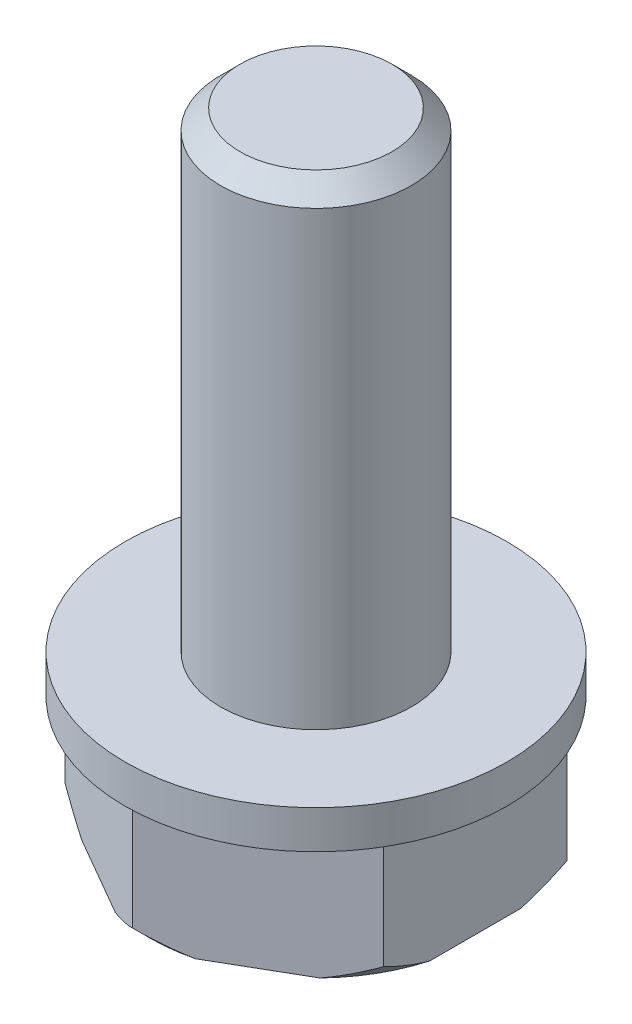
ISO-10303-21;
HEADER;
FILE_DESCRIPTION(('STEP AP214'),'2;1');
FILE_NAME('part.step','',(''),(''),'','','');
FILE_SCHEMA(('AUTOMOTIVE_DESIGN { 1 0 10303 214 1 1 1 1 }'));
ENDSEC;
DATA;
#1=APPLICATION_CONTEXT('core data for automotive mechanical design processes');
#2=APPLICATION_PROTOCOL_DEFINITION('international standard','automotive_design',2000,#1);
#3=PRODUCT_CONTEXT('',#1,'mechanical');
#4=PRODUCT('Part','Part','',(#3));
#5=PRODUCT_RELATED_PRODUCT_CATEGORY('part','',(#4));
#6=PRODUCT_DEFINITION_FORMATION('','',#4);
#7=PRODUCT_DEFINITION_CONTEXT('part definition',#1,'design');
#8=PRODUCT_DEFINITION('design','',#6,#7);
#9=PRODUCT_DEFINITION_SHAPE('','',#8);
#10=(LENGTH_UNIT() NAMED_UNIT(*) SI_UNIT(.MILLI.,.METRE.));
#11=(NAMED_UNIT(*) PLANE_ANGLE_UNIT() SI_UNIT($,.RADIAN.));
#12=(NAMED_UNIT(*) SI_UNIT($,.STERADIAN.) SOLID_ANGLE_UNIT());
#13=UNCERTAINTY_MEASURE_WITH_UNIT(LENGTH_MEASURE(1.E-05),#10,'distance_accuracy_value','');
#14=(GEOMETRIC_REPRESENTATION_CONTEXT(3) GLOBAL_UNCERTAINTY_ASSIGNED_CONTEXT((#13)) GLOBAL_UNIT_ASSIGNED_CONTEXT((#10,
#11,#12)) REPRESENTATION_CONTEXT('',''));
#15=CARTESIAN_POINT('',(0.,0.,0.));
#16=DIRECTION('',(0.,0.,1.));
#17=DIRECTION('',(1.,0.,0.));
#18=AXIS2_PLACEMENT_3D('',#15,#16,#17);
#19=CARTESIAN_POINT('',(-12.6776695296637,96.5,-20.5644208756118));
#20=DIRECTION('',(-0.5,0.,0.866025403784439));
#21=DIRECTION('',(0.866025403784439,0.,0.5));
#22=AXIS2_PLACEMENT_3D('',#19,#20,#21);
#23=PLANE('',#22);
#24=DIRECTION('',(0.,-1.,0.));
#25=VECTOR('',#24,1.);
#26=CARTESIAN_POINT('',(-12.6776695296637,96.5,-20.5644208756118));
#27=LINE('',#26,#25);
#28=CARTESIAN_POINT('',(-12.6776695296637,50.5,-20.5644208756118));
#29=VERTEX_POINT('',#28);
#30=CARTESIAN_POINT('',(-12.6776695296637,47.0735026918963,-20.5644208756118));
#31=VERTEX_POINT('',#30);
#32=EDGE_CURVE('E11',#29,#31,#27,.T.);
#33=ORIENTED_EDGE('',*,*,#32,.T.);
#34=CARTESIAN_POINT('',(-13.9407378419784,46.5,-21.2936537057316));
#35=CARTESIAN_POINT('',(-13.8888852998626,46.5164440766261,-21.2637151211004));
#36=CARTESIAN_POINT('',(-13.8372495435169,46.5337687545802,-21.2338904269128));
#37=CARTESIAN_POINT('',(-13.7338516018748,46.5702823086314,-21.1741594018992));
#38=CARTESIAN_POINT('',(-13.6820943622336,46.5894897238432,-21.1442558321939));
#39=CARTESIAN_POINT('',(-13.5783633971793,46.6297670931508,-21.0843293780453));
#40=CARTESIAN_POINT('',(-13.5263958373998,46.6508582920278,-21.054310131997));
#41=CARTESIAN_POINT('',(-13.4221600511645,46.6949003649628,-20.9941094242253));
#42=CARTESIAN_POINT('',(-13.3698991333133,46.7178745106764,-20.9639323574686));
#43=CARTESIAN_POINT('',(-13.2649997798865,46.7656807395659,-20.9033725653862));
#44=CARTESIAN_POINT('',(-13.212369709376,46.7905375181192,-20.8729948770988));
#45=CARTESIAN_POINT('',(-13.1066617384088,46.8421079012049,-20.8119895662205));
#46=CARTESIAN_POINT('',(-13.0535931424491,46.8688470805479,-20.7813674698508));
#47=CARTESIAN_POINT('',(-12.9469443837856,46.9241810640024,-20.7198294215317));
#48=CARTESIAN_POINT('',(-12.8933743396931,46.9528018406309,-20.6889193342318));
#49=CARTESIAN_POINT('',(-12.7856642307774,47.0119007649667,-20.6267615953025));
#50=CARTESIAN_POINT('',(-12.7315349477506,47.042404941688,-20.5955199875061));
#51=CARTESIAN_POINT('',(-12.6776695296637,47.0735026918963,-20.5644208756118));
#52=B_SPLINE_CURVE_WITH_KNOTS('',3,(#34,#35,#36,#37,#38,#39,#40,#41,#42,#43,#44,#45,#46,#47,#48,
#49,#50,#51),.UNSPECIFIED.,.F.,.F.,(4,2,2,2,2,2,2,2,4),(0.,0.18626522227709,0.374595608167034,
0.565412784427951,0.759111232115711,0.956057798253881,1.15659171756843,1.36102506604505,
1.56964356219137),.UNSPECIFIED.);
#53=CARTESIAN_POINT('',(-13.9407378419784,46.5,-21.2936537057316));
#54=VERTEX_POINT('',#53);
#55=EDGE_CURVE('E342',#54,#31,#52,.T.);
#56=ORIENTED_EDGE('',*,*,#55,.F.);
#57=DIRECTION('',(0.866025403784439,0.,0.5));
#58=VECTOR('',#57,1.);
#59=CARTESIAN_POINT('',(-11.2776695296637,46.5,-19.7561304987464));
#60=LINE('',#59,#58);
#61=CARTESIAN_POINT('',(-16.414601217349,46.5,-22.7219393914402));
#62=VERTEX_POINT('',#61);
#63=EDGE_CURVE('E347',#62,#54,#60,.T.);
#64=ORIENTED_EDGE('',*,*,#63,.F.);
#65=CARTESIAN_POINT('',(-17.6776695296637,47.0735026918963,-23.45117222156));
#66=CARTESIAN_POINT('',(-17.6238041996847,47.042404941688,-23.4200729570584));
#67=CARTESIAN_POINT('',(-17.5696835321645,47.0119007649667,-23.3888164267667));
#68=CARTESIAN_POINT('',(-17.4619982967521,46.9528018406309,-23.326615605666));
#69=CARTESIAN_POINT('',(-17.4084443538709,46.9241810640024,-23.29567763025));
#70=CARTESIAN_POINT('',(-17.3018264613955,46.8688470805479,-23.2340861201248));
#71=CARTESIAN_POINT('',(-17.2487726500423,46.8421079012049,-23.2034384160655));
#72=CARTESIAN_POINT('',(-17.1430865155724,46.7905375181192,-23.1423952832645));
#73=CARTESIAN_POINT('',(-17.090463630552,46.7656807395659,-23.1120051493432));
#74=CARTESIAN_POINT('',(-16.9855676354473,46.7178745106764,-23.0514395404762));
#75=CARTESIAN_POINT('',(-16.9333030700988,46.6949003649628,-23.0212687913703));
#76=CARTESIAN_POINT('',(-16.829049834725,46.6508582920278,-22.9610983063928));
#77=CARTESIAN_POINT('',(-16.7770686251549,46.6297670931507,-22.9311027024754));
#78=CARTESIAN_POINT('',(-16.6733053109764,46.5894897238432,-22.8712322786535));
#79=CARTESIAN_POINT('',(-16.6215294401272,46.5702823086314,-22.8413609791471));
#80=CARTESIAN_POINT('',(-16.5181018842503,46.5337687545802,-22.7816812474928));
#81=CARTESIAN_POINT('',(-16.4664550632509,46.5164440766261,-22.7518757178476));
#82=CARTESIAN_POINT('',(-16.414601217349,46.5,-22.7219393914402));
#83=B_SPLINE_CURVE_WITH_KNOTS('',3,(#65,#66,#67,#68,#69,#70,#71,#72,#73,#74,#75,#76,#77,#78,#79,
#80,#81,#82),.UNSPECIFIED.,.F.,.F.,(4,2,2,2,2,2,2,2,4),(0.,0.208618496146344,0.413051844622974,
0.613585763937537,0.810532330075709,1.00423077776348,1.19504795402439,1.38337833991432,
1.5696435621914),.UNSPECIFIED.);
#84=CARTESIAN_POINT('',(-17.6776695296637,47.0735026918963,-23.4511722215599));
#85=VERTEX_POINT('',#84);
#86=EDGE_CURVE('E485',#85,#62,#83,.T.);
#87=ORIENTED_EDGE('',*,*,#86,.F.);
#88=DIRECTION('',(0.,-1.,0.));
#89=VECTOR('',#88,1.);
#90=CARTESIAN_POINT('',(-17.6776695296637,96.5,-23.4511722215599));
#91=LINE('',#90,#89);
#92=CARTESIAN_POINT('',(-17.6776695296637,50.5,-23.4511722215599));
#93=VERTEX_POINT('',#92);
#94=EDGE_CURVE('E364',#93,#85,#91,.T.);
#95=ORIENTED_EDGE('',*,*,#94,.F.);
#96=DIRECTION('',(-0.866025403784439,0.,-0.5));
#97=VECTOR('',#96,1.);
#98=CARTESIAN_POINT('',(-12.9276695296637,50.5,-20.7087584429092));
#99=LINE('',#98,#97);
#100=EDGE_CURVE('E489',#29,#93,#99,.T.);
#101=ORIENTED_EDGE('',*,*,#100,.F.);
#102=EDGE_LOOP('',(#33,#56,#64,#87,#95,#101));
#103=FACE_BOUND('',#102,.T.);
#104=ADVANCED_FACE('F16',(#103),#23,.F.);
#105=CARTESIAN_POINT('',(-12.6776695296637,96.5,-14.7909181837156));
#106=DIRECTION('',(-1.,0.,0.));
#107=DIRECTION('',(0.,0.,1.));
#108=AXIS2_PLACEMENT_3D('',#105,#106,#107);
#109=PLANE('',#108);
#110=DIRECTION('',(0.,-1.,0.));
#111=VECTOR('',#110,1.);
#112=CARTESIAN_POINT('',(-12.6776695296637,96.5,-14.7909181837156));
#113=LINE('',#112,#111);
#114=CARTESIAN_POINT('',(-12.6776695296637,50.5,-14.7909181837156));
#115=VERTEX_POINT('',#114);
#116=CARTESIAN_POINT('',(-12.6776695296637,47.0735026918963,-14.7909181837156));
#117=VERTEX_POINT('',#116);
#118=EDGE_CURVE('E127',#115,#117,#113,.T.);
#119=ORIENTED_EDGE('',*,*,#118,.T.);
#120=CARTESIAN_POINT('',(-12.6776695296637,46.5,-16.2493838439551));
#121=CARTESIAN_POINT('',(-12.6776708334498,46.5164440766261,-16.1895089329165));
#122=CARTESIAN_POINT('',(-12.6776818981035,46.5337687545802,-16.1298787090837));
#123=CARTESIAN_POINT('',(-12.6777115123383,46.5702823086314,-16.0104679524158));
#124=CARTESIAN_POINT('',(-12.6777301435463,46.5894897238432,-15.9506930832041));
#125=CARTESIAN_POINT('',(-12.6777624926705,46.6297670931507,-15.8308962052337));
#126=CARTESIAN_POINT('',(-12.6777761424612,46.6508582920278,-15.7708813552678));
#127=CARTESIAN_POINT('',(-12.6777935915996,46.6949003649628,-15.6505101625187));
#128=CARTESIAN_POINT('',(-12.677797239097,46.7178745106764,-15.5901623466561));
#129=CARTESIAN_POINT('',(-12.6777938807748,46.7656807395659,-15.4690369457068));
#130=CARTESIAN_POINT('',(-12.6777866952847,46.7905375181192,-15.408269123498));
#131=CARTESIAN_POINT('',(-12.6777648587874,46.8421079012049,-15.2862206798188));
#132=CARTESIAN_POINT('',(-12.677750074181,46.8688470805479,-15.2249508793897));
#133=CARTESIAN_POINT('',(-12.6777192079928,46.9241810640024,-15.1018213209455));
#134=CARTESIAN_POINT('',(-12.6777031067814,46.9528018406309,-15.0399732582295));
#135=CARTESIAN_POINT('',(-12.6776782332782,47.0119007649667,-14.9156146981995));
#136=CARTESIAN_POINT('',(-12.6776696177716,47.042404941688,-14.8531165601114));
#137=CARTESIAN_POINT('',(-12.6776695296637,47.0735026918963,-14.7909181837156));
#138=B_SPLINE_CURVE_WITH_KNOTS('',3,(#120,#121,#122,#123,#124,#125,#126,#127,#128,#129,#130,
#131,#132,#133,#134,#135,#136,#137),.UNSPECIFIED.,.F.,.F.,(4,2,2,2,2,2,2,2,4),(0.,
0.186265222277092,0.37459560816703,0.565412784427947,0.759111232115713,0.956057798253881,
1.15659171756844,1.36102506604505,1.56964356219138),.UNSPECIFIED.);
#139=CARTESIAN_POINT('',(-12.6776695296637,46.5,-16.2493838439551));
#140=VERTEX_POINT('',#139);
#141=EDGE_CURVE('E29',#140,#117,#138,.T.);
#142=ORIENTED_EDGE('',*,*,#141,.F.);
#143=DIRECTION('',(0.,0.,1.));
#144=VECTOR('',#143,1.);
#145=CARTESIAN_POINT('',(-12.6776695296637,46.5,-17.6776695296637));
#146=LINE('',#145,#144);
#147=CARTESIAN_POINT('',(-12.6776695296637,46.5,-19.1059552153723));
#148=VERTEX_POINT('',#147);
#149=EDGE_CURVE('E292',#148,#140,#146,.T.);
#150=ORIENTED_EDGE('',*,*,#149,.F.);
#151=CARTESIAN_POINT('',(-12.6776695296637,47.0735026918963,-20.5644208756118));
#152=CARTESIAN_POINT('',(-12.6776696177716,47.0424049416879,-20.502222499216));
#153=CARTESIAN_POINT('',(-12.6776782332782,47.0119007649667,-20.4397243611279));
#154=CARTESIAN_POINT('',(-12.6777031067814,46.9528018406309,-20.3153658010979));
#155=CARTESIAN_POINT('',(-12.6777192079928,46.9241810640024,-20.2535177383819));
#156=CARTESIAN_POINT('',(-12.677750074181,46.8688470805479,-20.1303881799377));
#157=CARTESIAN_POINT('',(-12.6777648587874,46.8421079012049,-20.0691183795086));
#158=CARTESIAN_POINT('',(-12.6777866952847,46.7905375181192,-19.9470699358293));
#159=CARTESIAN_POINT('',(-12.6777938807748,46.7656807395659,-19.8863021136206));
#160=CARTESIAN_POINT('',(-12.677797239097,46.7178745106764,-19.7651767126712));
#161=CARTESIAN_POINT('',(-12.6777935915996,46.6949003649628,-19.7048288968087));
#162=CARTESIAN_POINT('',(-12.6777761424612,46.6508582920278,-19.5844577040595));
#163=CARTESIAN_POINT('',(-12.6777624926706,46.6297670931507,-19.5244428540937));
#164=CARTESIAN_POINT('',(-12.6777301435463,46.5894897238432,-19.4046459761233));
#165=CARTESIAN_POINT('',(-12.6777115123383,46.5702823086314,-19.3448711069116));
#166=CARTESIAN_POINT('',(-12.6776818981035,46.5337687545802,-19.2254603502437));
#167=CARTESIAN_POINT('',(-12.6776708334498,46.5164440766261,-19.1658301264109));
#168=CARTESIAN_POINT('',(-12.6776695296637,46.5,-19.1059552153723));
#169=B_SPLINE_CURVE_WITH_KNOTS('',3,(#151,#152,#153,#154,#155,#156,#157,#158,#159,#160,#161,
#162,#163,#164,#165,#166,#167,#168),.UNSPECIFIED.,.F.,.F.,(4,2,2,2,2,2,2,2,4),(0.,
0.208618496146355,0.413051844622993,0.613585763937558,0.810532330075726,1.00423077776349,
1.19504795402439,1.38337833991431,1.56964356219138),.UNSPECIFIED.);
#170=EDGE_CURVE('E123',#31,#148,#169,.T.);
#171=ORIENTED_EDGE('',*,*,#170,.F.);
#172=ORIENTED_EDGE('',*,*,#32,.F.);
#173=DIRECTION('',(0.,0.,-1.));
#174=VECTOR('',#173,1.);
#175=CARTESIAN_POINT('',(-12.6776695296637,50.5,-17.6776695296637));
#176=LINE('',#175,#174);
#177=EDGE_CURVE('E130',#115,#29,#176,.T.);
#178=ORIENTED_EDGE('',*,*,#177,.F.);
#179=EDGE_LOOP('',(#119,#142,#150,#171,#172,#178));
#180=FACE_BOUND('',#179,.T.);
#181=ADVANCED_FACE('F128',(#180),#109,.F.);
#182=CARTESIAN_POINT('',(-17.6776695296637,47.3,-17.6776695296637));
#183=DIRECTION('',(0.,1.,0.));
#184=DIRECTION('',(0.,0.,1.));
#185=AXIS2_PLACEMENT_3D('',#182,#183,#184);
#186=CONICAL_SURFACE('',#185,6.,0.785398163397448);
#187=CARTESIAN_POINT('',(-17.6776695296637,46.5,-17.6776695296637));
#188=DIRECTION('',(0.,-1.,0.));
#189=DIRECTION('',(0.,0.,-1.));
#190=AXIS2_PLACEMENT_3D('',#187,#188,#189);
#191=CIRCLE('',#190,5.2);
#192=CARTESIAN_POINT('',(-13.9407378419784,46.5,-14.0616853535958));
#193=VERTEX_POINT('',#192);
#194=EDGE_CURVE('E118',#140,#193,#191,.T.);
#195=ORIENTED_EDGE('',*,*,#194,.F.);
#196=ORIENTED_EDGE('',*,*,#141,.T.);
#197=CARTESIAN_POINT('',(-12.6776695296637,47.0735026918963,-14.7909181837156));
#198=CARTESIAN_POINT('',(-12.7315349477506,47.042404941688,-14.7598190718213));
#199=CARTESIAN_POINT('',(-12.7856642307774,47.0119007649667,-14.7285774640249));
#200=CARTESIAN_POINT('',(-12.8933743396931,46.9528018406309,-14.6664197250956));
#201=CARTESIAN_POINT('',(-12.9469443837856,46.9241810640024,-14.6355096377956));
#202=CARTESIAN_POINT('',(-13.0535931424492,46.8688470805479,-14.5739715894766));
#203=CARTESIAN_POINT('',(-13.1066617384088,46.8421079012049,-14.5433494931068));
#204=CARTESIAN_POINT('',(-13.212369709376,46.7905375181192,-14.4823441822286));
#205=CARTESIAN_POINT('',(-13.2649997798865,46.7656807395659,-14.4519664939412));
#206=CARTESIAN_POINT('',(-13.3698991333133,46.7178745106764,-14.3914067018588));
#207=CARTESIAN_POINT('',(-13.4221600511645,46.6949003649628,-14.3612296351021));
#208=CARTESIAN_POINT('',(-13.5263958373999,46.6508582920278,-14.3010289273304));
#209=CARTESIAN_POINT('',(-13.5783633971793,46.6297670931507,-14.2710096812821));
#210=CARTESIAN_POINT('',(-13.6820943622336,46.5894897238432,-14.2110832271335));
#211=CARTESIAN_POINT('',(-13.7338516018748,46.5702823086314,-14.1811796574282));
#212=CARTESIAN_POINT('',(-13.8372495435169,46.5337687545802,-14.1214486324146));
#213=CARTESIAN_POINT('',(-13.8888852998626,46.5164440766261,-14.091623938227));
#214=CARTESIAN_POINT('',(-13.9407378419784,46.5,-14.0616853535958));
#215=B_SPLINE_CURVE_WITH_KNOTS('',3,(#197,#198,#199,#200,#201,#202,#203,#204,#205,#206,#207,
#208,#209,#210,#211,#212,#213,#214),.UNSPECIFIED.,.F.,.F.,(4,2,2,2,2,2,2,2,4),(0.,
0.208618496146339,0.413051844622964,0.613585763937522,0.810532330075691,1.00423077776346,
1.19504795402436,1.3833783399143,1.56964356219138),.UNSPECIFIED.);
#216=EDGE_CURVE('E115',#117,#193,#215,.T.);
#217=ORIENTED_EDGE('',*,*,#216,.T.);
#218=EDGE_LOOP('',(#195,#196,#217));
#219=FACE_BOUND('',#218,.T.);
#220=ADVANCED_FACE('F113',(#219),#186,.T.);
#221=CARTESIAN_POINT('',(-17.6776695296637,47.3,-17.6776695296637));
#222=DIRECTION('',(0.,1.,0.));
#223=DIRECTION('',(0.,0.,1.));
#224=AXIS2_PLACEMENT_3D('',#221,#222,#223);
#225=CONICAL_SURFACE('',#224,6.,0.785398163397448);
#226=CARTESIAN_POINT('',(-17.6776695296637,46.5,-17.6776695296637));
#227=DIRECTION('',(0.,-1.,0.));
#228=DIRECTION('',(0.,0.,-1.));
#229=AXIS2_PLACEMENT_3D('',#226,#227,#228);
#230=CIRCLE('',#229,5.2);
#231=EDGE_CURVE('E294',#54,#148,#230,.T.);
#232=ORIENTED_EDGE('',*,*,#231,.F.);
#233=ORIENTED_EDGE('',*,*,#55,.T.);
#234=ORIENTED_EDGE('',*,*,#170,.T.);
#235=EDGE_LOOP('',(#232,#233,#234));
#236=FACE_BOUND('',#235,.T.);
#237=ADVANCED_FACE('F315',(#236),#225,.T.);
#238=CARTESIAN_POINT('',(-17.6776695296637,47.3,-17.6776695296637));
#239=DIRECTION('',(0.,1.,0.));
#240=DIRECTION('',(0.,0.,1.));
#241=AXIS2_PLACEMENT_3D('',#238,#239,#240);
#242=CONICAL_SURFACE('',#241,6.,0.785398163397448);
#243=CARTESIAN_POINT('',(-17.6776695296637,46.5,-17.6776695296637));
#244=DIRECTION('',(0.,-1.,0.));
#245=DIRECTION('',(0.,0.,-1.));
#246=AXIS2_PLACEMENT_3D('',#243,#244,#245);
#247=CIRCLE('',#246,5.2);
#248=CARTESIAN_POINT('',(-18.9407378419784,46.5,-22.7219393914402));
#249=VERTEX_POINT('',#248);
#250=EDGE_CURVE('E376',#249,#62,#247,.T.);
#251=ORIENTED_EDGE('',*,*,#250,.F.);
#252=CARTESIAN_POINT('',(-18.9407378419784,46.5,-22.7219393914402));
#253=CARTESIAN_POINT('',(-18.8888839960765,46.5164440766261,-22.7518757178476));
#254=CARTESIAN_POINT('',(-18.8372371750771,46.5337687545802,-22.7816812474928));
#255=CARTESIAN_POINT('',(-18.7338096192002,46.5702823086314,-22.8413609791471));
#256=CARTESIAN_POINT('',(-18.682033748351,46.5894897238432,-22.8712322786535));
#257=CARTESIAN_POINT('',(-18.5782704341724,46.6297670931507,-22.9311027024754));
#258=CARTESIAN_POINT('',(-18.5262892246024,46.6508582920278,-22.9610983063928));
#259=CARTESIAN_POINT('',(-18.4220359892286,46.6949003649628,-23.0212687913703));
#260=CARTESIAN_POINT('',(-18.36977142388,46.7178745106764,-23.0514395404762));
#261=CARTESIAN_POINT('',(-18.2648754287754,46.7656807395659,-23.1120051493432));
#262=CARTESIAN_POINT('',(-18.212252543755,46.7905375181192,-23.1423952832645));
#263=CARTESIAN_POINT('',(-18.1065664092851,46.8421079012049,-23.2034384160655));
#264=CARTESIAN_POINT('',(-18.0535125979319,46.8688470805479,-23.2340861201248));
#265=CARTESIAN_POINT('',(-17.9468947054565,46.9241810640024,-23.29567763025));
#266=CARTESIAN_POINT('',(-17.8933407625753,46.9528018406309,-23.326615605666));
#267=CARTESIAN_POINT('',(-17.7856555271629,47.0119007649667,-23.3888164267667));
#268=CARTESIAN_POINT('',(-17.7315348596427,47.042404941688,-23.4200729570583));
#269=CARTESIAN_POINT('',(-17.6776695296637,47.0735026918963,-23.45117222156));
#270=B_SPLINE_CURVE_WITH_KNOTS('',3,(#252,#253,#254,#255,#256,#257,#258,#259,#260,#261,#262,
#263,#264,#265,#266,#267,#268,#269),.UNSPECIFIED.,.F.,.F.,(4,2,2,2,2,2,2,2,4),(0.,
0.186265222277085,0.374595608167022,0.565412784427936,0.759111232115702,0.956057798253874,
1.15659171756843,1.36102506604505,1.56964356219139),.UNSPECIFIED.);
#271=EDGE_CURVE('E372',#249,#85,#270,.T.);
#272=ORIENTED_EDGE('',*,*,#271,.T.);
#273=ORIENTED_EDGE('',*,*,#86,.T.);
#274=EDGE_LOOP('',(#251,#272,#273));
#275=FACE_BOUND('',#274,.T.);
#276=ADVANCED_FACE('F324',(#275),#242,.T.);
#277=CARTESIAN_POINT('',(-17.6776695296637,51.7,-17.6776695296637));
#278=DIRECTION('',(0.,-1.,0.));
#279=DIRECTION('',(0.,0.,-1.));
#280=AXIS2_PLACEMENT_3D('',#277,#278,#279);
#281=PLANE('',#280);
#282=CARTESIAN_POINT('',(-17.6776695296637,51.7,-17.6776695296637));
#283=DIRECTION('',(0.,-1.,0.));
#284=DIRECTION('',(0.,0.,-1.));
#285=AXIS2_PLACEMENT_3D('',#282,#283,#284);
#286=CIRCLE('',#285,3.);
#287=CARTESIAN_POINT('',(-17.6776695296637,51.7,-20.6776695296637));
#288=VERTEX_POINT('',#287);
#289=EDGE_CURVE('E467',#288,#288,#286,.T.);
#290=ORIENTED_EDGE('',*,*,#289,.T.);
#291=EDGE_LOOP('',(#290));
#292=FACE_BOUND('',#291,.T.);
#293=CARTESIAN_POINT('',(-17.6776695296637,51.7,-17.6776695296637));
#294=DIRECTION('',(0.,-1.,0.));
#295=DIRECTION('',(0.,0.,-1.));
#296=AXIS2_PLACEMENT_3D('',#293,#294,#295);
#297=CIRCLE('',#296,6.);
#298=CARTESIAN_POINT('',(-17.6776695296637,51.7,-23.6776695296637));
#299=VERTEX_POINT('',#298);
#300=EDGE_CURVE('E484',#299,#299,#297,.T.);
#301=ORIENTED_EDGE('',*,*,#300,.F.);
#302=EDGE_LOOP('',(#301));
#303=FACE_BOUND('',#302,.T.);
#304=ADVANCED_FACE('F325',(#292,#303),#281,.F.);
#305=CARTESIAN_POINT('',(-17.6776695296637,47.3,-17.6776695296637));
#306=DIRECTION('',(0.,1.,0.));
#307=DIRECTION('',(0.,0.,1.));
#308=AXIS2_PLACEMENT_3D('',#305,#306,#307);
#309=CONICAL_SURFACE('',#308,6.,0.785398163397448);
#310=CARTESIAN_POINT('',(-17.6776695296637,46.5,-17.6776695296637));
#311=DIRECTION('',(0.,-1.,0.));
#312=DIRECTION('',(0.,0.,-1.));
#313=AXIS2_PLACEMENT_3D('',#310,#311,#312);
#314=CIRCLE('',#313,5.2);
#315=CARTESIAN_POINT('',(-22.6776695296637,46.5,-19.1059552153723));
#316=VERTEX_POINT('',#315);
#317=CARTESIAN_POINT('',(-21.414601217349,46.5,-21.2936537057316));
#318=VERTEX_POINT('',#317);
#319=EDGE_CURVE('E415',#316,#318,#314,.T.);
#320=ORIENTED_EDGE('',*,*,#319,.F.);
#321=CARTESIAN_POINT('',(-22.6776695296637,46.5,-19.1059552153723));
#322=CARTESIAN_POINT('',(-22.6776682258776,46.5164440766261,-19.165830126411));
#323=CARTESIAN_POINT('',(-22.6776571612239,46.5337687545802,-19.2254603502438));
#324=CARTESIAN_POINT('',(-22.6776275469891,46.5702823086314,-19.3448711069116));
#325=CARTESIAN_POINT('',(-22.6776089157811,46.5894897238432,-19.4046459761234));
#326=CARTESIAN_POINT('',(-22.6775765666569,46.6297670931507,-19.5244428540937));
#327=CARTESIAN_POINT('',(-22.6775629168662,46.6508582920278,-19.5844577040596));
#328=CARTESIAN_POINT('',(-22.6775454677278,46.6949003649628,-19.7048288968087));
#329=CARTESIAN_POINT('',(-22.6775418202304,46.7178745106764,-19.7651767126713));
#330=CARTESIAN_POINT('',(-22.6775451785526,46.7656807395659,-19.8863021136206));
#331=CARTESIAN_POINT('',(-22.6775523640427,46.7905375181192,-19.9470699358294));
#332=CARTESIAN_POINT('',(-22.67757420054,46.8421079012049,-20.0691183795086));
#333=CARTESIAN_POINT('',(-22.6775889851464,46.8688470805479,-20.1303881799377));
#334=CARTESIAN_POINT('',(-22.6776198513346,46.9241810640024,-20.2535177383819));
#335=CARTESIAN_POINT('',(-22.677635952546,46.9528018406309,-20.3153658010979));
#336=CARTESIAN_POINT('',(-22.6776608260492,47.0119007649667,-20.4397243611279));
#337=CARTESIAN_POINT('',(-22.6776694415558,47.042404941688,-20.502222499216));
#338=CARTESIAN_POINT('',(-22.6776695296637,47.0735026918963,-20.5644208756118));
#339=B_SPLINE_CURVE_WITH_KNOTS('',3,(#321,#322,#323,#324,#325,#326,#327,#328,#329,#330,#331,
#332,#333,#334,#335,#336,#337,#338),.UNSPECIFIED.,.F.,.F.,(4,2,2,2,2,2,2,2,4),(0.,
0.186265222277079,0.37459560816701,0.565412784427924,0.759111232115682,0.956057798253853,
1.15659171756841,1.36102506604504,1.56964356219137),.UNSPECIFIED.);
#340=CARTESIAN_POINT('',(-22.6776695296637,47.0735026918963,-20.5644208756118));
#341=VERTEX_POINT('',#340);
#342=EDGE_CURVE('E373',#316,#341,#339,.T.);
#343=ORIENTED_EDGE('',*,*,#342,.T.);
#344=CARTESIAN_POINT('',(-22.6776695296637,47.0735026918963,-20.5644208756118));
#345=CARTESIAN_POINT('',(-22.6238041115768,47.042404941688,-20.5955199875061));
#346=CARTESIAN_POINT('',(-22.56967482855,47.0119007649667,-20.6267615953026));
#347=CARTESIAN_POINT('',(-22.4619647196343,46.9528018406309,-20.6889193342319));
#348=CARTESIAN_POINT('',(-22.4083946755418,46.9241810640024,-20.7198294215318));
#349=CARTESIAN_POINT('',(-22.3017459168782,46.8688470805479,-20.7813674698508));
#350=CARTESIAN_POINT('',(-22.2486773209186,46.8421079012049,-20.8119895662206));
#351=CARTESIAN_POINT('',(-22.1429693499514,46.7905375181192,-20.8729948770989));
#352=CARTESIAN_POINT('',(-22.0903392794409,46.7656807395659,-20.9033725653862));
#353=CARTESIAN_POINT('',(-21.9854399260141,46.7178745106764,-20.9639323574686));
#354=CARTESIAN_POINT('',(-21.9331790081629,46.6949003649628,-20.9941094242253));
#355=CARTESIAN_POINT('',(-21.8289432219275,46.6508582920278,-21.054310131997));
#356=CARTESIAN_POINT('',(-21.7769756621481,46.6297670931507,-21.0843293780454));
#357=CARTESIAN_POINT('',(-21.6732446970938,46.5894897238432,-21.1442558321939));
#358=CARTESIAN_POINT('',(-21.6214874574525,46.5702823086314,-21.1741594018992));
#359=CARTESIAN_POINT('',(-21.5180895158105,46.5337687545802,-21.2338904269128));
#360=CARTESIAN_POINT('',(-21.4664537594648,46.5164440766261,-21.2637151211004));
#361=CARTESIAN_POINT('',(-21.414601217349,46.5,-21.2936537057316));
#362=B_SPLINE_CURVE_WITH_KNOTS('',3,(#344,#345,#346,#347,#348,#349,#350,#351,#352,#353,#354,
#355,#356,#357,#358,#359,#360,#361),.UNSPECIFIED.,.F.,.F.,(4,2,2,2,2,2,2,2,4),(0.,
0.208618496146346,0.413051844622972,0.61358576393753,0.810532330075706,1.00423077776347,
1.19504795402438,1.3833783399143,1.56964356219138),.UNSPECIFIED.);
#363=EDGE_CURVE('E387',#341,#318,#362,.T.);
#364=ORIENTED_EDGE('',*,*,#363,.T.);
#365=EDGE_LOOP('',(#320,#343,#364));
#366=FACE_BOUND('',#365,.T.);
#367=ADVANCED_FACE('F277',(#366),#309,.T.);
#368=CARTESIAN_POINT('',(-17.6776695296637,50.5,-17.6776695296637));
#369=DIRECTION('',(0.,-1.,0.));
#370=DIRECTION('',(0.,0.,-1.));
#371=AXIS2_PLACEMENT_3D('',#368,#369,#370);
#372=CYLINDRICAL_SURFACE('',#371,6.);
#373=ORIENTED_EDGE('',*,*,#300,.T.);
#374=EDGE_LOOP('',(#373));
#375=FACE_BOUND('',#374,.T.);
#376=CARTESIAN_POINT('',(-17.6776695296637,50.5,-17.6776695296637));
#377=DIRECTION('',(0.,-1.,0.));
#378=DIRECTION('',(0.,0.,-1.));
#379=AXIS2_PLACEMENT_3D('',#376,#377,#378);
#380=CIRCLE('',#379,6.);
#381=CARTESIAN_POINT('',(-17.6776695296637,50.5,-23.6776695296637));
#382=VERTEX_POINT('',#381);
#383=EDGE_CURVE('E410',#382,#382,#380,.T.);
#384=ORIENTED_EDGE('',*,*,#383,.F.);
#385=EDGE_LOOP('',(#384));
#386=FACE_BOUND('',#385,.T.);
#387=ADVANCED_FACE('F469',(#375,#386),#372,.T.);
#388=CARTESIAN_POINT('',(-17.6776695296637,96.5,-23.4511722215599));
#389=DIRECTION('',(0.5,0.,0.866025403784439));
#390=DIRECTION('',(0.866025403784439,0.,-0.5));
#391=AXIS2_PLACEMENT_3D('',#388,#389,#390);
#392=PLANE('',#391);
#393=ORIENTED_EDGE('',*,*,#94,.T.);
#394=ORIENTED_EDGE('',*,*,#271,.F.);
#395=DIRECTION('',(0.866025403784439,0.,-0.5));
#396=VECTOR('',#395,1.);
#397=CARTESIAN_POINT('',(-16.2776695296637,46.5,-24.2594625984254));
#398=LINE('',#397,#396);
#399=EDGE_CURVE('E379',#318,#249,#398,.T.);
#400=ORIENTED_EDGE('',*,*,#399,.F.);
#401=ORIENTED_EDGE('',*,*,#363,.F.);
#402=DIRECTION('',(0.,-1.,0.));
#403=VECTOR('',#402,1.);
#404=CARTESIAN_POINT('',(-22.6776695296637,96.5,-20.5644208756118));
#405=LINE('',#404,#403);
#406=CARTESIAN_POINT('',(-22.6776695296637,50.5,-20.5644208756118));
#407=VERTEX_POINT('',#406);
#408=EDGE_CURVE('E402',#407,#341,#405,.T.);
#409=ORIENTED_EDGE('',*,*,#408,.F.);
#410=DIRECTION('',(-0.866025403784439,0.,0.5));
#411=VECTOR('',#410,1.);
#412=CARTESIAN_POINT('',(-17.9276695296637,50.5,-23.3068346542625));
#413=LINE('',#412,#411);
#414=EDGE_CURVE('E491',#93,#407,#413,.T.);
#415=ORIENTED_EDGE('',*,*,#414,.F.);
#416=EDGE_LOOP('',(#393,#394,#400,#401,#409,#415));
#417=FACE_BOUND('',#416,.T.);
#418=ADVANCED_FACE('F178',(#417),#392,.F.);
#419=CARTESIAN_POINT('',(-22.6776695296637,96.5,-20.5644208756118));
#420=DIRECTION('',(1.,0.,0.));
#421=DIRECTION('',(0.,0.,-1.));
#422=AXIS2_PLACEMENT_3D('',#419,#420,#421);
#423=PLANE('',#422);
#424=ORIENTED_EDGE('',*,*,#408,.T.);
#425=ORIENTED_EDGE('',*,*,#342,.F.);
#426=DIRECTION('',(0.,0.,-1.));
#427=VECTOR('',#426,1.);
#428=CARTESIAN_POINT('',(-22.6776695296637,46.5,-17.6776695296637));
#429=LINE('',#428,#427);
#430=CARTESIAN_POINT('',(-22.6776695296637,46.5,-16.2493838439551));
#431=VERTEX_POINT('',#430);
#432=EDGE_CURVE('E260',#431,#316,#429,.T.);
#433=ORIENTED_EDGE('',*,*,#432,.F.);
#434=CARTESIAN_POINT('',(-22.6776695296637,47.0735026918963,-14.7909181837156));
#435=CARTESIAN_POINT('',(-22.6776694415558,47.0424049416879,-14.8531165601114));
#436=CARTESIAN_POINT('',(-22.6776608260492,47.0119007649667,-14.9156146981995));
#437=CARTESIAN_POINT('',(-22.677635952546,46.9528018406309,-15.0399732582295));
#438=CARTESIAN_POINT('',(-22.6776198513346,46.9241810640024,-15.1018213209455));
#439=CARTESIAN_POINT('',(-22.6775889851464,46.8688470805479,-15.2249508793897));
#440=CARTESIAN_POINT('',(-22.67757420054,46.8421079012049,-15.2862206798188));
#441=CARTESIAN_POINT('',(-22.6775523640427,46.7905375181192,-15.4082691234981));
#442=CARTESIAN_POINT('',(-22.6775451785526,46.7656807395659,-15.4690369457068));
#443=CARTESIAN_POINT('',(-22.6775418202304,46.7178745106764,-15.5901623466562));
#444=CARTESIAN_POINT('',(-22.6775454677278,46.6949003649628,-15.6505101625188));
#445=CARTESIAN_POINT('',(-22.6775629168662,46.6508582920278,-15.7708813552679));
#446=CARTESIAN_POINT('',(-22.6775765666568,46.6297670931507,-15.8308962052337));
#447=CARTESIAN_POINT('',(-22.6776089157811,46.5894897238432,-15.9506930832041));
#448=CARTESIAN_POINT('',(-22.6776275469891,46.5702823086314,-16.0104679524158));
#449=CARTESIAN_POINT('',(-22.6776571612239,46.5337687545802,-16.1298787090837));
#450=CARTESIAN_POINT('',(-22.6776682258776,46.5164440766261,-16.1895089329164));
#451=CARTESIAN_POINT('',(-22.6776695296637,46.5,-16.2493838439551));
#452=B_SPLINE_CURVE_WITH_KNOTS('',3,(#434,#435,#436,#437,#438,#439,#440,#441,#442,#443,#444,
#445,#446,#447,#448,#449,#450,#451),.UNSPECIFIED.,.F.,.F.,(4,2,2,2,2,2,2,2,4),(0.,
0.208618496146364,0.413051844623001,0.613585763937566,0.810532330075742,1.0042307777635,
1.1950479540244,1.38337833991432,1.56964356219138),.UNSPECIFIED.);
#453=CARTESIAN_POINT('',(-22.6776695296637,47.0735026918963,-14.7909181837156));
#454=VERTEX_POINT('',#453);
#455=EDGE_CURVE('E236',#454,#431,#452,.T.);
#456=ORIENTED_EDGE('',*,*,#455,.F.);
#457=DIRECTION('',(0.,-1.,0.));
#458=VECTOR('',#457,1.);
#459=CARTESIAN_POINT('',(-22.6776695296637,96.5,-14.7909181837156));
#460=LINE('',#459,#458);
#461=CARTESIAN_POINT('',(-22.6776695296637,50.5,-14.7909181837156));
#462=VERTEX_POINT('',#461);
#463=EDGE_CURVE('E247',#462,#454,#460,.T.);
#464=ORIENTED_EDGE('',*,*,#463,.F.);
#465=DIRECTION('',(0.,0.,1.));
#466=VECTOR('',#465,1.);
#467=CARTESIAN_POINT('',(-22.6776695296637,50.5,-17.6776695296637));
#468=LINE('',#467,#466);
#469=EDGE_CURVE('E494',#407,#462,#468,.T.);
#470=ORIENTED_EDGE('',*,*,#469,.F.);
#471=EDGE_LOOP('',(#424,#425,#433,#456,#464,#470));
#472=FACE_BOUND('',#471,.T.);
#473=ADVANCED_FACE('F18',(#472),#423,.F.);
#474=CARTESIAN_POINT('',(-11.6776695296637,50.5,-17.6776695296637));
#475=DIRECTION('',(0.,1.,0.));
#476=DIRECTION('',(0.,0.,1.));
#477=AXIS2_PLACEMENT_3D('',#474,#475,#476);
#478=PLANE('',#477);
#479=ORIENTED_EDGE('',*,*,#383,.T.);
#480=EDGE_LOOP('',(#479));
#481=FACE_BOUND('',#480,.T.);
#482=ORIENTED_EDGE('',*,*,#177,.T.);
#483=ORIENTED_EDGE('',*,*,#100,.T.);
#484=ORIENTED_EDGE('',*,*,#414,.T.);
#485=ORIENTED_EDGE('',*,*,#469,.T.);
#486=DIRECTION('',(0.866025403784439,0.,0.5));
#487=VECTOR('',#486,1.);
#488=CARTESIAN_POINT('',(-17.9276695296637,50.5,-12.0485044050648));
#489=LINE('',#488,#487);
#490=CARTESIAN_POINT('',(-17.6776695296637,50.5,-11.9041668377674));
#491=VERTEX_POINT('',#490);
#492=EDGE_CURVE('E246',#462,#491,#489,.T.);
#493=ORIENTED_EDGE('',*,*,#492,.T.);
#494=DIRECTION('',(0.866025403784439,0.,-0.5));
#495=VECTOR('',#494,1.);
#496=CARTESIAN_POINT('',(-12.9276695296637,50.5,-14.6465806164181));
#497=LINE('',#496,#495);
#498=EDGE_CURVE('E134',#491,#115,#497,.T.);
#499=ORIENTED_EDGE('',*,*,#498,.T.);
#500=EDGE_LOOP('',(#482,#483,#484,#485,#493,#499));
#501=FACE_BOUND('',#500,.T.);
#502=ADVANCED_FACE('F160',(#481,#501),#478,.F.);
#503=CARTESIAN_POINT('',(-17.6776695296637,66.5,-17.6776695296637));
#504=DIRECTION('',(0.,-1.,0.));
#505=DIRECTION('',(0.,0.,-1.));
#506=AXIS2_PLACEMENT_3D('',#503,#504,#505);
#507=CONICAL_SURFACE('',#506,2.3865,0.785398163397446);
#508=CARTESIAN_POINT('',(-17.6776695296637,66.5,-17.6776695296637));
#509=DIRECTION('',(0.,-1.,0.));
#510=DIRECTION('',(0.,0.,-1.));
#511=AXIS2_PLACEMENT_3D('',#508,#509,#510);
#512=CIRCLE('',#511,2.3865);
#513=CARTESIAN_POINT('',(-17.6776695296637,66.5,-20.0641695296637));
#514=VERTEX_POINT('',#513);
#515=EDGE_CURVE('E496',#514,#514,#512,.T.);
#516=ORIENTED_EDGE('',*,*,#515,.T.);
#517=EDGE_LOOP('',(#516));
#518=FACE_BOUND('',#517,.T.);
#519=CARTESIAN_POINT('',(-17.6776695296637,65.8865,-17.6776695296637));
#520=DIRECTION('',(0.,-1.,0.));
#521=DIRECTION('',(0.,0.,-1.));
#522=AXIS2_PLACEMENT_3D('',#519,#520,#521);
#523=CIRCLE('',#522,3.);
#524=CARTESIAN_POINT('',(-17.6776695296637,65.8865,-20.6776695296637));
#525=VERTEX_POINT('',#524);
#526=EDGE_CURVE('E497',#525,#525,#523,.T.);
#527=ORIENTED_EDGE('',*,*,#526,.F.);
#528=EDGE_LOOP('',(#527));
#529=FACE_BOUND('',#528,.T.);
#530=ADVANCED_FACE('F164',(#518,#529),#507,.T.);
#531=CARTESIAN_POINT('',(-17.6776695296637,66.5,-17.6776695296637));
#532=DIRECTION('',(0.,-1.,0.));
#533=DIRECTION('',(0.,0.,-1.));
#534=AXIS2_PLACEMENT_3D('',#531,#532,#533);
#535=PLANE('',#534);
#536=ORIENTED_EDGE('',*,*,#515,.F.);
#537=EDGE_LOOP('',(#536));
#538=FACE_BOUND('',#537,.T.);
#539=ADVANCED_FACE('F166',(#538),#535,.F.);
#540=CARTESIAN_POINT('',(-17.6776695296637,46.5,-17.6776695296637));
#541=DIRECTION('',(0.,-1.,0.));
#542=DIRECTION('',(0.,0.,-1.));
#543=AXIS2_PLACEMENT_3D('',#540,#541,#542);
#544=CYLINDRICAL_SURFACE('',#543,3.);
#545=ORIENTED_EDGE('',*,*,#526,.T.);
#546=EDGE_LOOP('',(#545));
#547=FACE_BOUND('',#546,.T.);
#548=ORIENTED_EDGE('',*,*,#289,.F.);
#549=EDGE_LOOP('',(#548));
#550=FACE_BOUND('',#549,.T.);
#551=ADVANCED_FACE('F169',(#547,#550),#544,.T.);
#552=CARTESIAN_POINT('',(-17.6776695296637,47.3,-17.6776695296637));
#553=DIRECTION('',(0.,1.,0.));
#554=DIRECTION('',(0.,0.,1.));
#555=AXIS2_PLACEMENT_3D('',#552,#553,#554);
#556=CONICAL_SURFACE('',#555,6.,0.785398163397448);
#557=CARTESIAN_POINT('',(-17.6776695296637,46.5,-17.6776695296637));
#558=DIRECTION('',(0.,-1.,0.));
#559=DIRECTION('',(0.,0.,-1.));
#560=AXIS2_PLACEMENT_3D('',#557,#558,#559);
#561=CIRCLE('',#560,5.2);
#562=CARTESIAN_POINT('',(-16.414601217349,46.5,-12.6333996678872));
#563=VERTEX_POINT('',#562);
#564=CARTESIAN_POINT('',(-18.9407378419784,46.5,-12.6333996678872));
#565=VERTEX_POINT('',#564);
#566=EDGE_CURVE('E234',#563,#565,#561,.T.);
#567=ORIENTED_EDGE('',*,*,#566,.F.);
#568=CARTESIAN_POINT('',(-16.414601217349,46.5,-12.6333996678872));
#569=CARTESIAN_POINT('',(-16.4664550632509,46.5164440766261,-12.6034633414798));
#570=CARTESIAN_POINT('',(-16.5181018842503,46.5337687545802,-12.5736578118346));
#571=CARTESIAN_POINT('',(-16.6215294401272,46.5702823086314,-12.5139780801803));
#572=CARTESIAN_POINT('',(-16.6733053109764,46.5894897238432,-12.4841067806739));
#573=CARTESIAN_POINT('',(-16.777068625155,46.6297670931507,-12.424236356852));
#574=CARTESIAN_POINT('',(-16.829049834725,46.6508582920278,-12.3942407529346));
#575=CARTESIAN_POINT('',(-16.9333030700988,46.6949003649628,-12.3340702679571));
#576=CARTESIAN_POINT('',(-16.9855676354474,46.7178745106764,-12.3038995188512));
#577=CARTESIAN_POINT('',(-17.090463630552,46.7656807395659,-12.2433339099842));
#578=CARTESIAN_POINT('',(-17.1430865155724,46.7905375181192,-12.2129437760629));
#579=CARTESIAN_POINT('',(-17.2487726500423,46.8421079012049,-12.1519006432619));
#580=CARTESIAN_POINT('',(-17.3018264613955,46.8688470805479,-12.1212529392026));
#581=CARTESIAN_POINT('',(-17.4084443538709,46.9241810640024,-12.0596614290774));
#582=CARTESIAN_POINT('',(-17.4619982967521,46.9528018406309,-12.0287234536614));
#583=CARTESIAN_POINT('',(-17.5696835321645,47.0119007649667,-11.9665226325607));
#584=CARTESIAN_POINT('',(-17.6238041996847,47.0424049416879,-11.9352661022691));
#585=CARTESIAN_POINT('',(-17.6776695296637,47.0735026918963,-11.9041668377675));
#586=B_SPLINE_CURVE_WITH_KNOTS('',3,(#568,#569,#570,#571,#572,#573,#574,#575,#576,#577,#578,
#579,#580,#581,#582,#583,#584,#585),.UNSPECIFIED.,.F.,.F.,(4,2,2,2,2,2,2,2,4),(0.,
0.186265222277092,0.374595608167029,0.565412784427946,0.759111232115712,0.956057798253876,
1.15659171756843,1.36102506604505,1.56964356219137),.UNSPECIFIED.);
#587=CARTESIAN_POINT('',(-17.6776695296637,47.0735026918963,-11.9041668377674));
#588=VERTEX_POINT('',#587);
#589=EDGE_CURVE('E231',#563,#588,#586,.T.);
#590=ORIENTED_EDGE('',*,*,#589,.T.);
#591=CARTESIAN_POINT('',(-17.6776695296637,47.0735026918963,-11.9041668377674));
#592=CARTESIAN_POINT('',(-17.7315348596427,47.042404941688,-11.9352661022691));
#593=CARTESIAN_POINT('',(-17.7856555271629,47.0119007649667,-11.9665226325607));
#594=CARTESIAN_POINT('',(-17.8933407625753,46.9528018406309,-12.0287234536614));
#595=CARTESIAN_POINT('',(-17.9468947054565,46.9241810640024,-12.0596614290774));
#596=CARTESIAN_POINT('',(-18.0535125979319,46.8688470805479,-12.1212529392026));
#597=CARTESIAN_POINT('',(-18.1065664092851,46.8421079012049,-12.1519006432619));
#598=CARTESIAN_POINT('',(-18.212252543755,46.7905375181192,-12.2129437760629));
#599=CARTESIAN_POINT('',(-18.2648754287754,46.7656807395659,-12.2433339099842));
#600=CARTESIAN_POINT('',(-18.36977142388,46.7178745106764,-12.3038995188512));
#601=CARTESIAN_POINT('',(-18.4220359892286,46.6949003649628,-12.3340702679571));
#602=CARTESIAN_POINT('',(-18.5262892246024,46.6508582920278,-12.3942407529346));
#603=CARTESIAN_POINT('',(-18.5782704341724,46.6297670931507,-12.424236356852));
#604=CARTESIAN_POINT('',(-18.682033748351,46.5894897238432,-12.4841067806739));
#605=CARTESIAN_POINT('',(-18.7338096192002,46.5702823086314,-12.5139780801803));
#606=CARTESIAN_POINT('',(-18.8372371750771,46.5337687545802,-12.5736578118346));
#607=CARTESIAN_POINT('',(-18.8888839960765,46.5164440766261,-12.6034633414798));
#608=CARTESIAN_POINT('',(-18.9407378419784,46.5,-12.6333996678872));
#609=B_SPLINE_CURVE_WITH_KNOTS('',3,(#591,#592,#593,#594,#595,#596,#597,#598,#599,#600,#601,
#602,#603,#604,#605,#606,#607,#608),.UNSPECIFIED.,.F.,.F.,(4,2,2,2,2,2,2,2,4),(0.,
0.208618496146341,0.413051844622973,0.613585763937532,0.810532330075702,1.00423077776347,
1.19504795402437,1.3833783399143,1.56964356219138),.UNSPECIFIED.);
#610=EDGE_CURVE('E241',#588,#565,#609,.T.);
#611=ORIENTED_EDGE('',*,*,#610,.T.);
#612=EDGE_LOOP('',(#567,#590,#611));
#613=FACE_BOUND('',#612,.T.);
#614=ADVANCED_FACE('F176',(#613),#556,.T.);
#615=CARTESIAN_POINT('',(-17.6776695296637,47.3,-17.6776695296637));
#616=DIRECTION('',(0.,1.,0.));
#617=DIRECTION('',(0.,0.,1.));
#618=AXIS2_PLACEMENT_3D('',#615,#616,#617);
#619=CONICAL_SURFACE('',#618,6.,0.785398163397448);
#620=CARTESIAN_POINT('',(-21.414601217349,46.5,-14.0616853535958));
#621=CARTESIAN_POINT('',(-21.4664537594648,46.5164440766261,-14.091623938227));
#622=CARTESIAN_POINT('',(-21.5180895158105,46.5337687545802,-14.1214486324146));
#623=CARTESIAN_POINT('',(-21.6214874574526,46.5702823086314,-14.1811796574282));
#624=CARTESIAN_POINT('',(-21.6732446970938,46.5894897238432,-14.2110832271335));
#625=CARTESIAN_POINT('',(-21.7769756621481,46.6297670931508,-14.2710096812821));
#626=CARTESIAN_POINT('',(-21.8289432219276,46.6508582920278,-14.3010289273305));
#627=CARTESIAN_POINT('',(-21.9331790081629,46.6949003649628,-14.3612296351021));
#628=CARTESIAN_POINT('',(-21.9854399260141,46.7178745106764,-14.3914067018588));
#629=CARTESIAN_POINT('',(-22.0903392794409,46.7656807395659,-14.4519664939412));
#630=CARTESIAN_POINT('',(-22.1429693499514,46.7905375181192,-14.4823441822286));
#631=CARTESIAN_POINT('',(-22.2486773209186,46.8421079012049,-14.5433494931069));
#632=CARTESIAN_POINT('',(-22.3017459168783,46.8688470805479,-14.5739715894766));
#633=CARTESIAN_POINT('',(-22.4083946755418,46.9241810640024,-14.6355096377957));
#634=CARTESIAN_POINT('',(-22.4619647196343,46.9528018406309,-14.6664197250956));
#635=CARTESIAN_POINT('',(-22.56967482855,47.0119007649667,-14.7285774640249));
#636=CARTESIAN_POINT('',(-22.6238041115768,47.042404941688,-14.7598190718213));
#637=CARTESIAN_POINT('',(-22.6776695296637,47.0735026918963,-14.7909181837156));
#638=B_SPLINE_CURVE_WITH_KNOTS('',3,(#620,#621,#622,#623,#624,#625,#626,#627,#628,#629,#630,
#631,#632,#633,#634,#635,#636,#637),.UNSPECIFIED.,.F.,.F.,(4,2,2,2,2,2,2,2,4),(0.,
0.186265222277098,0.374595608167043,0.565412784427959,0.759111232115722,0.956057798253896,
1.15659171756844,1.36102506604505,1.56964356219137),.UNSPECIFIED.);
#639=CARTESIAN_POINT('',(-21.414601217349,46.5,-14.0616853535958));
#640=VERTEX_POINT('',#639);
#641=EDGE_CURVE('E204',#640,#454,#638,.T.);
#642=ORIENTED_EDGE('',*,*,#641,.T.);
#643=ORIENTED_EDGE('',*,*,#455,.T.);
#644=CARTESIAN_POINT('',(-17.6776695296637,46.5,-17.6776695296637));
#645=DIRECTION('',(0.,-1.,0.));
#646=DIRECTION('',(0.,0.,-1.));
#647=AXIS2_PLACEMENT_3D('',#644,#645,#646);
#648=CIRCLE('',#647,5.2);
#649=EDGE_CURVE('E258',#640,#431,#648,.T.);
#650=ORIENTED_EDGE('',*,*,#649,.F.);
#651=EDGE_LOOP('',(#642,#643,#650));
#652=FACE_BOUND('',#651,.T.);
#653=ADVANCED_FACE('F171',(#652),#619,.T.);
#654=CARTESIAN_POINT('',(-12.4776695296637,46.5,-17.6776695296637));
#655=DIRECTION('',(0.,1.,0.));
#656=DIRECTION('',(0.,0.,1.));
#657=AXIS2_PLACEMENT_3D('',#654,#655,#656);
#658=PLANE('',#657);
#659=ORIENTED_EDGE('',*,*,#649,.T.);
#660=ORIENTED_EDGE('',*,*,#432,.T.);
#661=ORIENTED_EDGE('',*,*,#319,.T.);
#662=ORIENTED_EDGE('',*,*,#399,.T.);
#663=ORIENTED_EDGE('',*,*,#250,.T.);
#664=ORIENTED_EDGE('',*,*,#63,.T.);
#665=ORIENTED_EDGE('',*,*,#231,.T.);
#666=ORIENTED_EDGE('',*,*,#149,.T.);
#667=ORIENTED_EDGE('',*,*,#194,.T.);
#668=DIRECTION('',(-0.866025403784439,0.,0.5));
#669=VECTOR('',#668,1.);
#670=CARTESIAN_POINT('',(-11.2776695296637,46.5,-15.5992085605811));
#671=LINE('',#670,#669);
#672=EDGE_CURVE('E141',#193,#563,#671,.T.);
#673=ORIENTED_EDGE('',*,*,#672,.T.);
#674=ORIENTED_EDGE('',*,*,#566,.T.);
#675=DIRECTION('',(-0.866025403784439,0.,-0.5));
#676=VECTOR('',#675,1.);
#677=CARTESIAN_POINT('',(-16.2776695296637,46.5,-11.0958764609019));
#678=LINE('',#677,#676);
#679=EDGE_CURVE('E239',#565,#640,#678,.T.);
#680=ORIENTED_EDGE('',*,*,#679,.T.);
#681=EDGE_LOOP('',(#659,#660,#661,#662,#663,#664,#665,#666,#667,#673,#674,#680));
#682=FACE_BOUND('',#681,.T.);
#683=ADVANCED_FACE('F175',(#682),#658,.F.);
#684=CARTESIAN_POINT('',(-22.6776695296637,96.5,-14.7909181837156));
#685=DIRECTION('',(0.5,0.,-0.866025403784439));
#686=DIRECTION('',(-0.866025403784439,0.,-0.5));
#687=AXIS2_PLACEMENT_3D('',#684,#685,#686);
#688=PLANE('',#687);
#689=ORIENTED_EDGE('',*,*,#463,.T.);
#690=ORIENTED_EDGE('',*,*,#641,.F.);
#691=ORIENTED_EDGE('',*,*,#679,.F.);
#692=ORIENTED_EDGE('',*,*,#610,.F.);
#693=DIRECTION('',(0.,-1.,0.));
#694=VECTOR('',#693,1.);
#695=CARTESIAN_POINT('',(-17.6776695296637,96.5,-11.9041668377674));
#696=LINE('',#695,#694);
#697=EDGE_CURVE('E224',#491,#588,#696,.T.);
#698=ORIENTED_EDGE('',*,*,#697,.F.);
#699=ORIENTED_EDGE('',*,*,#492,.F.);
#700=EDGE_LOOP('',(#689,#690,#691,#692,#698,#699));
#701=FACE_BOUND('',#700,.T.);
#702=ADVANCED_FACE('F159',(#701),#688,.F.);
#703=CARTESIAN_POINT('',(-17.6776695296637,96.5,-11.9041668377674));
#704=DIRECTION('',(-0.5,0.,-0.866025403784439));
#705=DIRECTION('',(-0.866025403784439,0.,0.5));
#706=AXIS2_PLACEMENT_3D('',#703,#704,#705);
#707=PLANE('',#706);
#708=ORIENTED_EDGE('',*,*,#697,.T.);
#709=ORIENTED_EDGE('',*,*,#589,.F.);
#710=ORIENTED_EDGE('',*,*,#672,.F.);
#711=ORIENTED_EDGE('',*,*,#216,.F.);
#712=ORIENTED_EDGE('',*,*,#118,.F.);
#713=ORIENTED_EDGE('',*,*,#498,.F.);
#714=EDGE_LOOP('',(#708,#709,#710,#711,#712,#713));
#715=FACE_BOUND('',#714,.T.);
#716=ADVANCED_FACE('F138',(#715),#707,.F.);
#717=CLOSED_SHELL('',(#104,#181,#220,#237,#276,#304,#367,#387,#418,#473,#502,#530,#539,#551,
#614,#653,#683,#702,#716));
#718=MANIFOLD_SOLID_BREP('B1',#717);
#719=ADVANCED_BREP_SHAPE_REPRESENTATION('',(#18,#718),#14);
#720=SHAPE_DEFINITION_REPRESENTATION(#9,#719);
ENDSEC;
END-ISO-10303-21;
